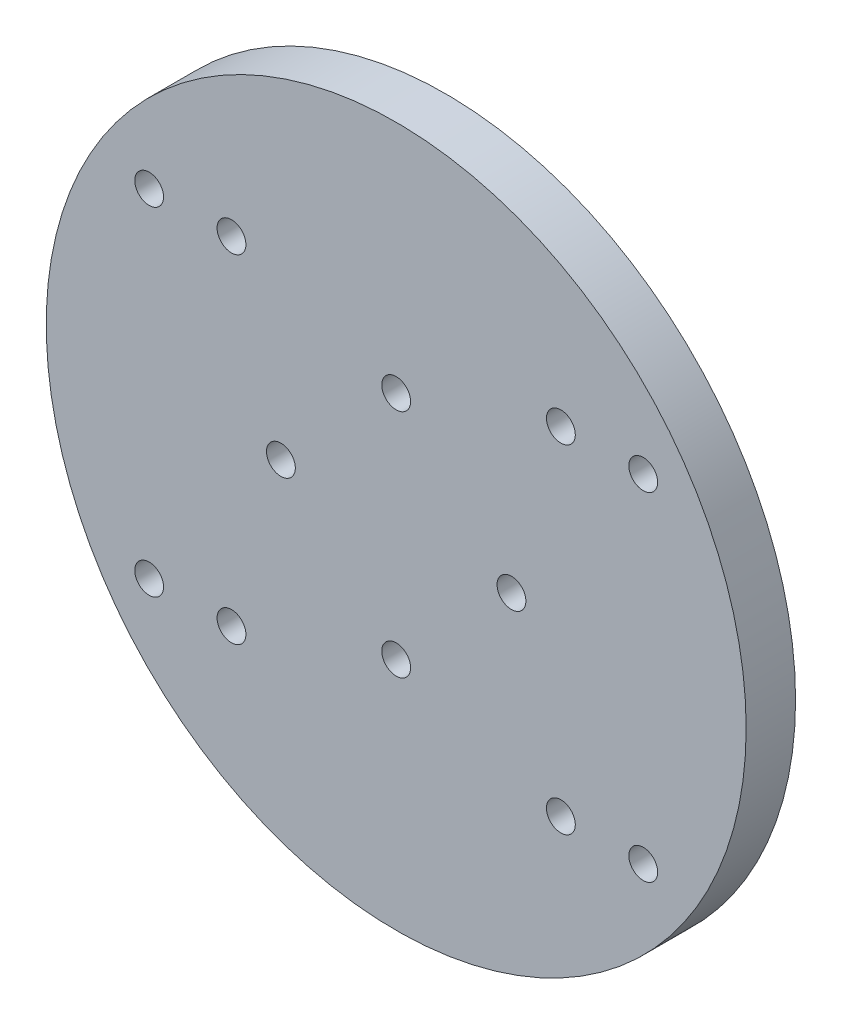
ISO-10303-21;
HEADER;
FILE_DESCRIPTION(('STEP AP214'),'2;1');
FILE_NAME('part.step','',(''),(''),'','','');
FILE_SCHEMA(('AUTOMOTIVE_DESIGN { 1 0 10303 214 1 1 1 1 }'));
ENDSEC;
DATA;
#1=APPLICATION_CONTEXT('core data for automotive mechanical design processes');
#2=APPLICATION_PROTOCOL_DEFINITION('international standard','automotive_design',2000,#1);
#3=PRODUCT_CONTEXT('',#1,'mechanical');
#4=PRODUCT('Part','Part','',(#3));
#5=PRODUCT_RELATED_PRODUCT_CATEGORY('part','',(#4));
#6=PRODUCT_DEFINITION_FORMATION('','',#4);
#7=PRODUCT_DEFINITION_CONTEXT('part definition',#1,'design');
#8=PRODUCT_DEFINITION('design','',#6,#7);
#9=PRODUCT_DEFINITION_SHAPE('','',#8);
#10=(LENGTH_UNIT() NAMED_UNIT(*) SI_UNIT(.MILLI.,.METRE.));
#11=(NAMED_UNIT(*) PLANE_ANGLE_UNIT() SI_UNIT($,.RADIAN.));
#12=(NAMED_UNIT(*) SI_UNIT($,.STERADIAN.) SOLID_ANGLE_UNIT());
#13=UNCERTAINTY_MEASURE_WITH_UNIT(LENGTH_MEASURE(1.E-05),#10,'distance_accuracy_value','');
#14=(GEOMETRIC_REPRESENTATION_CONTEXT(3) GLOBAL_UNCERTAINTY_ASSIGNED_CONTEXT((#13)) GLOBAL_UNIT_ASSIGNED_CONTEXT((#10,
#11,#12)) REPRESENTATION_CONTEXT('',''));
#15=CARTESIAN_POINT('',(0.,0.,0.));
#16=DIRECTION('',(0.,0.,1.));
#17=DIRECTION('',(1.,0.,0.));
#18=AXIS2_PLACEMENT_3D('',#15,#16,#17);
#19=CARTESIAN_POINT('',(0.,0.,0.));
#20=DIRECTION('',(0.,0.,1.));
#21=DIRECTION('',(1.,0.,0.));
#22=AXIS2_PLACEMENT_3D('',#19,#20,#21);
#23=PLANE('',#22);
#24=CARTESIAN_POINT('',(-29.9999914227974,-20.5,0.));
#25=DIRECTION('',(0.,0.,1.));
#26=DIRECTION('',(1.,0.,0.));
#27=AXIS2_PLACEMENT_3D('',#24,#25,#26);
#28=CIRCLE('',#27,2.9);
#29=CARTESIAN_POINT('',(-27.0999914227974,-20.5,0.));
#30=VERTEX_POINT('',#29);
#31=EDGE_CURVE('E273',#30,#30,#28,.T.);
#32=ORIENTED_EDGE('',*,*,#31,.T.);
#33=EDGE_LOOP('',(#32));
#34=FACE_BOUND('',#33,.T.);
#35=CARTESIAN_POINT('',(29.9999914227974,-20.5,0.));
#36=DIRECTION('',(0.,0.,-1.));
#37=DIRECTION('',(-1.,0.,0.));
#38=AXIS2_PLACEMENT_3D('',#35,#36,#37);
#39=CIRCLE('',#38,2.9);
#40=CARTESIAN_POINT('',(27.0999914227974,-20.5,0.));
#41=VERTEX_POINT('',#40);
#42=EDGE_CURVE('E285',#41,#41,#39,.T.);
#43=ORIENTED_EDGE('',*,*,#42,.F.);
#44=EDGE_LOOP('',(#43));
#45=FACE_BOUND('',#44,.T.);
#46=CARTESIAN_POINT('',(29.9999914227976,20.5,0.));
#47=DIRECTION('',(0.,0.,-1.));
#48=DIRECTION('',(-1.,0.,0.));
#49=AXIS2_PLACEMENT_3D('',#46,#47,#48);
#50=CIRCLE('',#49,2.9);
#51=CARTESIAN_POINT('',(27.0999914227976,20.5,0.));
#52=VERTEX_POINT('',#51);
#53=EDGE_CURVE('E282',#52,#52,#50,.T.);
#54=ORIENTED_EDGE('',*,*,#53,.F.);
#55=EDGE_LOOP('',(#54));
#56=FACE_BOUND('',#55,.T.);
#57=CARTESIAN_POINT('',(19.9999914227974,-20.5,0.));
#58=DIRECTION('',(0.,0.,1.));
#59=DIRECTION('',(1.,0.,0.));
#60=AXIS2_PLACEMENT_3D('',#57,#58,#59);
#61=CIRCLE('',#60,2.9);
#62=CARTESIAN_POINT('',(22.8999914227974,-20.5,0.));
#63=VERTEX_POINT('',#62);
#64=EDGE_CURVE('E145',#63,#63,#61,.T.);
#65=ORIENTED_EDGE('',*,*,#64,.T.);
#66=EDGE_LOOP('',(#65));
#67=FACE_BOUND('',#66,.T.);
#68=CARTESIAN_POINT('',(-19.9999914227974,-20.5,0.));
#69=DIRECTION('',(0.,0.,1.));
#70=DIRECTION('',(1.,0.,0.));
#71=AXIS2_PLACEMENT_3D('',#68,#69,#70);
#72=CIRCLE('',#71,2.9);
#73=CARTESIAN_POINT('',(-17.0999914227974,-20.5,0.));
#74=VERTEX_POINT('',#73);
#75=EDGE_CURVE('E137',#74,#74,#72,.T.);
#76=ORIENTED_EDGE('',*,*,#75,.T.);
#77=EDGE_LOOP('',(#76));
#78=FACE_BOUND('',#77,.T.);
#79=CARTESIAN_POINT('',(-19.9999914227974,20.5,0.));
#80=DIRECTION('',(0.,0.,1.));
#81=DIRECTION('',(1.,0.,0.));
#82=AXIS2_PLACEMENT_3D('',#79,#80,#81);
#83=CIRCLE('',#82,2.9);
#84=CARTESIAN_POINT('',(-17.0999914227974,20.5,0.));
#85=VERTEX_POINT('',#84);
#86=EDGE_CURVE('E128',#85,#85,#83,.T.);
#87=ORIENTED_EDGE('',*,*,#86,.T.);
#88=EDGE_LOOP('',(#87));
#89=FACE_BOUND('',#88,.T.);
#90=CARTESIAN_POINT('',(19.9999914227974,20.5,0.));
#91=DIRECTION('',(0.,0.,1.));
#92=DIRECTION('',(1.,0.,0.));
#93=AXIS2_PLACEMENT_3D('',#90,#91,#92);
#94=CIRCLE('',#93,2.9);
#95=CARTESIAN_POINT('',(22.8999914227974,20.5,0.));
#96=VERTEX_POINT('',#95);
#97=EDGE_CURVE('E132',#96,#96,#94,.T.);
#98=ORIENTED_EDGE('',*,*,#97,.T.);
#99=EDGE_LOOP('',(#98));
#100=FACE_BOUND('',#99,.T.);
#101=CARTESIAN_POINT('',(0.,0.,0.));
#102=DIRECTION('',(0.,0.,-1.));
#103=DIRECTION('',(-1.,0.,0.));
#104=AXIS2_PLACEMENT_3D('',#101,#102,#103);
#105=CIRCLE('',#104,22.);
#106=CARTESIAN_POINT('',(-22.,0.,0.));
#107=VERTEX_POINT('',#106);
#108=EDGE_CURVE('E52',#107,#107,#105,.T.);
#109=ORIENTED_EDGE('',*,*,#108,.F.);
#110=EDGE_LOOP('',(#109));
#111=FACE_BOUND('',#110,.T.);
#112=CARTESIAN_POINT('',(0.,0.,0.));
#113=DIRECTION('',(0.,0.,1.));
#114=DIRECTION('',(1.,0.,0.));
#115=AXIS2_PLACEMENT_3D('',#112,#113,#114);
#116=CIRCLE('',#115,42.5);
#117=CARTESIAN_POINT('',(42.5,0.,0.));
#118=VERTEX_POINT('',#117);
#119=EDGE_CURVE('E67',#118,#118,#116,.T.);
#120=ORIENTED_EDGE('',*,*,#119,.F.);
#121=EDGE_LOOP('',(#120));
#122=FACE_BOUND('',#121,.T.);
#123=CARTESIAN_POINT('',(-29.9999914227976,20.5,0.));
#124=DIRECTION('',(0.,0.,1.));
#125=DIRECTION('',(1.,0.,0.));
#126=AXIS2_PLACEMENT_3D('',#123,#124,#125);
#127=CIRCLE('',#126,2.9);
#128=CARTESIAN_POINT('',(-27.0999914227976,20.5,0.));
#129=VERTEX_POINT('',#128);
#130=EDGE_CURVE('E264',#129,#129,#127,.T.);
#131=ORIENTED_EDGE('',*,*,#130,.T.);
#132=EDGE_LOOP('',(#131));
#133=FACE_BOUND('',#132,.T.);
#134=ADVANCED_FACE('F43',(#34,#45,#56,#67,#78,#89,#100,#111,#122,#133),#23,.F.);
#135=CARTESIAN_POINT('',(29.9999914227976,20.5,-4.));
#136=DIRECTION('',(0.,0.,1.));
#137=DIRECTION('',(1.,0.,0.));
#138=AXIS2_PLACEMENT_3D('',#135,#136,#137);
#139=CYLINDRICAL_SURFACE('',#138,1.75);
#140=CARTESIAN_POINT('',(29.9999914227976,20.5,6.));
#141=DIRECTION('',(0.,0.,-1.));
#142=DIRECTION('',(-1.,0.,0.));
#143=AXIS2_PLACEMENT_3D('',#140,#141,#142);
#144=CIRCLE('',#143,1.75);
#145=CARTESIAN_POINT('',(28.2499914227976,20.5,6.));
#146=VERTEX_POINT('',#145);
#147=EDGE_CURVE('E113',#146,#146,#144,.T.);
#148=ORIENTED_EDGE('',*,*,#147,.F.);
#149=EDGE_LOOP('',(#148));
#150=FACE_BOUND('',#149,.T.);
#151=CARTESIAN_POINT('',(29.9999914227976,20.5,3.3));
#152=DIRECTION('',(0.,0.,-1.));
#153=DIRECTION('',(-1.,0.,0.));
#154=AXIS2_PLACEMENT_3D('',#151,#152,#153);
#155=CIRCLE('',#154,1.75);
#156=CARTESIAN_POINT('',(28.2499914227976,20.5,3.3));
#157=VERTEX_POINT('',#156);
#158=EDGE_CURVE('E97',#157,#157,#155,.T.);
#159=ORIENTED_EDGE('',*,*,#158,.T.);
#160=EDGE_LOOP('',(#159));
#161=FACE_BOUND('',#160,.T.);
#162=ADVANCED_FACE('F234',(#150,#161),#139,.F.);
#163=CARTESIAN_POINT('',(29.9999914227974,-20.5,-4.));
#164=DIRECTION('',(0.,0.,1.));
#165=DIRECTION('',(1.,0.,0.));
#166=AXIS2_PLACEMENT_3D('',#163,#164,#165);
#167=CYLINDRICAL_SURFACE('',#166,1.75);
#168=CARTESIAN_POINT('',(29.9999914227974,-20.5,6.));
#169=DIRECTION('',(0.,0.,-1.));
#170=DIRECTION('',(-1.,0.,0.));
#171=AXIS2_PLACEMENT_3D('',#168,#169,#170);
#172=CIRCLE('',#171,1.75);
#173=CARTESIAN_POINT('',(28.2499914227974,-20.5,6.));
#174=VERTEX_POINT('',#173);
#175=EDGE_CURVE('E108',#174,#174,#172,.T.);
#176=ORIENTED_EDGE('',*,*,#175,.F.);
#177=EDGE_LOOP('',(#176));
#178=FACE_BOUND('',#177,.T.);
#179=CARTESIAN_POINT('',(29.9999914227974,-20.5,3.3));
#180=DIRECTION('',(0.,0.,-1.));
#181=DIRECTION('',(-1.,0.,0.));
#182=AXIS2_PLACEMENT_3D('',#179,#180,#181);
#183=CIRCLE('',#182,1.75);
#184=CARTESIAN_POINT('',(28.2499914227974,-20.5,3.3));
#185=VERTEX_POINT('',#184);
#186=EDGE_CURVE('E93',#185,#185,#183,.T.);
#187=ORIENTED_EDGE('',*,*,#186,.T.);
#188=EDGE_LOOP('',(#187));
#189=FACE_BOUND('',#188,.T.);
#190=ADVANCED_FACE('F240',(#178,#189),#167,.F.);
#191=CARTESIAN_POINT('',(0.,0.,6.));
#192=DIRECTION('',(0.,0.,1.));
#193=DIRECTION('',(1.,0.,0.));
#194=AXIS2_PLACEMENT_3D('',#191,#192,#193);
#195=PLANE('',#194);
#196=ORIENTED_EDGE('',*,*,#147,.T.);
#197=EDGE_LOOP('',(#196));
#198=FACE_BOUND('',#197,.T.);
#199=CARTESIAN_POINT('',(-29.9999914227976,20.5,6.));
#200=DIRECTION('',(0.,0.,1.));
#201=DIRECTION('',(1.,0.,0.));
#202=AXIS2_PLACEMENT_3D('',#199,#200,#201);
#203=CIRCLE('',#202,1.75);
#204=CARTESIAN_POINT('',(-28.2499914227976,20.5,6.));
#205=VERTEX_POINT('',#204);
#206=EDGE_CURVE('E119',#205,#205,#203,.T.);
#207=ORIENTED_EDGE('',*,*,#206,.F.);
#208=EDGE_LOOP('',(#207));
#209=FACE_BOUND('',#208,.T.);
#210=CARTESIAN_POINT('',(-29.9999914227974,-20.5,6.));
#211=DIRECTION('',(0.,0.,1.));
#212=DIRECTION('',(1.,0.,0.));
#213=AXIS2_PLACEMENT_3D('',#210,#211,#212);
#214=CIRCLE('',#213,1.75);
#215=CARTESIAN_POINT('',(-28.2499914227974,-20.5,6.));
#216=VERTEX_POINT('',#215);
#217=EDGE_CURVE('E123',#216,#216,#214,.T.);
#218=ORIENTED_EDGE('',*,*,#217,.F.);
#219=EDGE_LOOP('',(#218));
#220=FACE_BOUND('',#219,.T.);
#221=CARTESIAN_POINT('',(19.9999914227974,20.5,6.));
#222=DIRECTION('',(0.,0.,1.));
#223=DIRECTION('',(1.,0.,0.));
#224=AXIS2_PLACEMENT_3D('',#221,#222,#223);
#225=CIRCLE('',#224,1.75);
#226=CARTESIAN_POINT('',(21.7499914227974,20.5,6.));
#227=VERTEX_POINT('',#226);
#228=EDGE_CURVE('E158',#227,#227,#225,.T.);
#229=ORIENTED_EDGE('',*,*,#228,.F.);
#230=EDGE_LOOP('',(#229));
#231=FACE_BOUND('',#230,.T.);
#232=CARTESIAN_POINT('',(19.9999914227974,-20.5,6.));
#233=DIRECTION('',(0.,0.,1.));
#234=DIRECTION('',(1.,0.,0.));
#235=AXIS2_PLACEMENT_3D('',#232,#233,#234);
#236=CIRCLE('',#235,1.75);
#237=CARTESIAN_POINT('',(21.7499914227974,-20.5,6.));
#238=VERTEX_POINT('',#237);
#239=EDGE_CURVE('E162',#238,#238,#236,.T.);
#240=ORIENTED_EDGE('',*,*,#239,.F.);
#241=EDGE_LOOP('',(#240));
#242=FACE_BOUND('',#241,.T.);
#243=CARTESIAN_POINT('',(-14.,0.,6.));
#244=DIRECTION('',(0.,0.,-1.));
#245=DIRECTION('',(-1.,0.,0.));
#246=AXIS2_PLACEMENT_3D('',#243,#244,#245);
#247=CIRCLE('',#246,1.75);
#248=CARTESIAN_POINT('',(-15.75,0.,6.));
#249=VERTEX_POINT('',#248);
#250=EDGE_CURVE('E174',#249,#249,#247,.T.);
#251=ORIENTED_EDGE('',*,*,#250,.T.);
#252=EDGE_LOOP('',(#251));
#253=FACE_BOUND('',#252,.T.);
#254=CARTESIAN_POINT('',(0.,-14.,6.));
#255=DIRECTION('',(0.,0.,-1.));
#256=DIRECTION('',(-1.,0.,0.));
#257=AXIS2_PLACEMENT_3D('',#254,#255,#256);
#258=CIRCLE('',#257,1.75);
#259=CARTESIAN_POINT('',(-1.74999999999995,-14.,6.));
#260=VERTEX_POINT('',#259);
#261=EDGE_CURVE('E187',#260,#260,#258,.T.);
#262=ORIENTED_EDGE('',*,*,#261,.T.);
#263=EDGE_LOOP('',(#262));
#264=FACE_BOUND('',#263,.T.);
#265=CARTESIAN_POINT('',(14.,0.,6.));
#266=DIRECTION('',(0.,0.,-1.));
#267=DIRECTION('',(-1.,0.,0.));
#268=AXIS2_PLACEMENT_3D('',#265,#266,#267);
#269=CIRCLE('',#268,1.75);
#270=CARTESIAN_POINT('',(12.25,0.,6.));
#271=VERTEX_POINT('',#270);
#272=EDGE_CURVE('E195',#271,#271,#269,.T.);
#273=ORIENTED_EDGE('',*,*,#272,.T.);
#274=EDGE_LOOP('',(#273));
#275=FACE_BOUND('',#274,.T.);
#276=CARTESIAN_POINT('',(-1.46707548625861E-13,14.,6.));
#277=DIRECTION('',(0.,0.,-1.));
#278=DIRECTION('',(-1.,0.,0.));
#279=AXIS2_PLACEMENT_3D('',#276,#277,#278);
#280=CIRCLE('',#279,1.75);
#281=CARTESIAN_POINT('',(-1.75000000000015,14.,6.));
#282=VERTEX_POINT('',#281);
#283=EDGE_CURVE('E173',#282,#282,#280,.T.);
#284=ORIENTED_EDGE('',*,*,#283,.T.);
#285=EDGE_LOOP('',(#284));
#286=FACE_BOUND('',#285,.T.);
#287=CARTESIAN_POINT('',(0.,0.,6.));
#288=DIRECTION('',(0.,0.,1.));
#289=DIRECTION('',(1.,0.,0.));
#290=AXIS2_PLACEMENT_3D('',#287,#288,#289);
#291=CIRCLE('',#290,42.5);
#292=CARTESIAN_POINT('',(42.5,0.,6.));
#293=VERTEX_POINT('',#292);
#294=EDGE_CURVE('E58',#293,#293,#291,.T.);
#295=ORIENTED_EDGE('',*,*,#294,.T.);
#296=EDGE_LOOP('',(#295));
#297=FACE_BOUND('',#296,.T.);
#298=CARTESIAN_POINT('',(-19.9999914227974,20.5,6.));
#299=DIRECTION('',(0.,0.,-1.));
#300=DIRECTION('',(-1.,0.,0.));
#301=AXIS2_PLACEMENT_3D('',#298,#299,#300);
#302=CIRCLE('',#301,1.75);
#303=CARTESIAN_POINT('',(-21.7499914227974,20.5,6.));
#304=VERTEX_POINT('',#303);
#305=EDGE_CURVE('E163',#304,#304,#302,.T.);
#306=ORIENTED_EDGE('',*,*,#305,.T.);
#307=EDGE_LOOP('',(#306));
#308=FACE_BOUND('',#307,.T.);
#309=CARTESIAN_POINT('',(-19.9999914227974,-20.5,6.));
#310=DIRECTION('',(0.,0.,-1.));
#311=DIRECTION('',(-1.,0.,0.));
#312=AXIS2_PLACEMENT_3D('',#309,#310,#311);
#313=CIRCLE('',#312,1.75);
#314=CARTESIAN_POINT('',(-21.7499914227974,-20.5,6.));
#315=VERTEX_POINT('',#314);
#316=EDGE_CURVE('E92',#315,#315,#313,.T.);
#317=ORIENTED_EDGE('',*,*,#316,.T.);
#318=EDGE_LOOP('',(#317));
#319=FACE_BOUND('',#318,.T.);
#320=ORIENTED_EDGE('',*,*,#175,.T.);
#321=EDGE_LOOP('',(#320));
#322=FACE_BOUND('',#321,.T.);
#323=ADVANCED_FACE('F246',(#198,#209,#220,#231,#242,#253,#264,#275,#286,#297,#308,#319,#322),
#195,.T.);
#324=CARTESIAN_POINT('',(0.,0.,6.));
#325=DIRECTION('',(0.,0.,-1.));
#326=DIRECTION('',(-1.,0.,0.));
#327=AXIS2_PLACEMENT_3D('',#324,#325,#326);
#328=CYLINDRICAL_SURFACE('',#327,42.5);
#329=ORIENTED_EDGE('',*,*,#294,.F.);
#330=EDGE_LOOP('',(#329));
#331=FACE_BOUND('',#330,.T.);
#332=ORIENTED_EDGE('',*,*,#119,.T.);
#333=EDGE_LOOP('',(#332));
#334=FACE_BOUND('',#333,.T.);
#335=ADVANCED_FACE('F45',(#331,#334),#328,.T.);
#336=CARTESIAN_POINT('',(0.,0.,-6.));
#337=DIRECTION('',(0.,0.,1.));
#338=DIRECTION('',(1.,0.,0.));
#339=AXIS2_PLACEMENT_3D('',#336,#337,#338);
#340=CYLINDRICAL_SURFACE('',#339,22.);
#341=CARTESIAN_POINT('',(0.,0.,-6.));
#342=DIRECTION('',(0.,0.,-1.));
#343=DIRECTION('',(-1.,0.,0.));
#344=AXIS2_PLACEMENT_3D('',#341,#342,#343);
#345=CIRCLE('',#344,22.);
#346=CARTESIAN_POINT('',(-22.,0.,-6.));
#347=VERTEX_POINT('',#346);
#348=EDGE_CURVE('E64',#347,#347,#345,.T.);
#349=ORIENTED_EDGE('',*,*,#348,.F.);
#350=EDGE_LOOP('',(#349));
#351=FACE_BOUND('',#350,.T.);
#352=ORIENTED_EDGE('',*,*,#108,.T.);
#353=EDGE_LOOP('',(#352));
#354=FACE_BOUND('',#353,.T.);
#355=ADVANCED_FACE('F230',(#351,#354),#340,.T.);
#356=CARTESIAN_POINT('',(0.,0.,-6.));
#357=DIRECTION('',(0.,0.,-1.));
#358=DIRECTION('',(-1.,0.,0.));
#359=AXIS2_PLACEMENT_3D('',#356,#357,#358);
#360=PLANE('',#359);
#361=CARTESIAN_POINT('',(0.,0.,-6.));
#362=DIRECTION('',(0.,0.,-1.));
#363=DIRECTION('',(-1.,0.,0.));
#364=AXIS2_PLACEMENT_3D('',#361,#362,#363);
#365=CIRCLE('',#364,20.1);
#366=CARTESIAN_POINT('',(-20.1,0.,-6.));
#367=VERTEX_POINT('',#366);
#368=EDGE_CURVE('E10',#367,#367,#365,.T.);
#369=ORIENTED_EDGE('',*,*,#368,.F.);
#370=EDGE_LOOP('',(#369));
#371=FACE_BOUND('',#370,.T.);
#372=ORIENTED_EDGE('',*,*,#348,.T.);
#373=EDGE_LOOP('',(#372));
#374=FACE_BOUND('',#373,.T.);
#375=ADVANCED_FACE('F225',(#371,#374),#360,.T.);
#376=CARTESIAN_POINT('',(0.,0.,-10.7));
#377=DIRECTION('',(0.,0.,1.));
#378=DIRECTION('',(1.,0.,0.));
#379=AXIS2_PLACEMENT_3D('',#376,#377,#378);
#380=CYLINDRICAL_SURFACE('',#379,20.1);
#381=CARTESIAN_POINT('',(0.,0.,-10.7));
#382=DIRECTION('',(0.,0.,-1.));
#383=DIRECTION('',(-1.,0.,0.));
#384=AXIS2_PLACEMENT_3D('',#381,#382,#383);
#385=CIRCLE('',#384,20.1);
#386=CARTESIAN_POINT('',(-20.1,0.,-10.7));
#387=VERTEX_POINT('',#386);
#388=EDGE_CURVE('E62',#387,#387,#385,.T.);
#389=ORIENTED_EDGE('',*,*,#388,.F.);
#390=EDGE_LOOP('',(#389));
#391=FACE_BOUND('',#390,.T.);
#392=ORIENTED_EDGE('',*,*,#368,.T.);
#393=EDGE_LOOP('',(#392));
#394=FACE_BOUND('',#393,.T.);
#395=ADVANCED_FACE('F218',(#391,#394),#380,.T.);
#396=CARTESIAN_POINT('',(0.,0.,-10.7));
#397=DIRECTION('',(0.,0.,-1.));
#398=DIRECTION('',(-1.,0.,0.));
#399=AXIS2_PLACEMENT_3D('',#396,#397,#398);
#400=PLANE('',#399);
#401=CARTESIAN_POINT('',(0.,0.,-10.7));
#402=DIRECTION('',(0.,0.,-1.));
#403=DIRECTION('',(-1.,0.,0.));
#404=AXIS2_PLACEMENT_3D('',#401,#402,#403);
#405=CIRCLE('',#404,18.1);
#406=CARTESIAN_POINT('',(-18.1,0.,-10.7));
#407=VERTEX_POINT('',#406);
#408=EDGE_CURVE('E178',#407,#407,#405,.T.);
#409=ORIENTED_EDGE('',*,*,#408,.F.);
#410=EDGE_LOOP('',(#409));
#411=FACE_BOUND('',#410,.T.);
#412=ORIENTED_EDGE('',*,*,#388,.T.);
#413=EDGE_LOOP('',(#412));
#414=FACE_BOUND('',#413,.T.);
#415=ADVANCED_FACE('F215',(#411,#414),#400,.T.);
#416=CARTESIAN_POINT('',(0.,0.,0.299999999999998));
#417=DIRECTION('',(0.,0.,-1.));
#418=DIRECTION('',(-1.,0.,0.));
#419=AXIS2_PLACEMENT_3D('',#416,#417,#418);
#420=CYLINDRICAL_SURFACE('',#419,18.1);
#421=CARTESIAN_POINT('',(0.,0.,0.299999999999998));
#422=DIRECTION('',(0.,0.,-1.));
#423=DIRECTION('',(-1.,0.,0.));
#424=AXIS2_PLACEMENT_3D('',#421,#422,#423);
#425=CIRCLE('',#424,18.1);
#426=CARTESIAN_POINT('',(-18.1,0.,0.299999999999998));
#427=VERTEX_POINT('',#426);
#428=EDGE_CURVE('E206',#427,#427,#425,.T.);
#429=ORIENTED_EDGE('',*,*,#428,.F.);
#430=EDGE_LOOP('',(#429));
#431=FACE_BOUND('',#430,.T.);
#432=ORIENTED_EDGE('',*,*,#408,.T.);
#433=EDGE_LOOP('',(#432));
#434=FACE_BOUND('',#433,.T.);
#435=ADVANCED_FACE('F213',(#431,#434),#420,.F.);
#436=CARTESIAN_POINT('',(0.,0.,0.299999999999998));
#437=DIRECTION('',(0.,0.,-1.));
#438=DIRECTION('',(-1.,0.,0.));
#439=AXIS2_PLACEMENT_3D('',#436,#437,#438);
#440=PLANE('',#439);
#441=CARTESIAN_POINT('',(-14.,0.,0.299999999999998));
#442=DIRECTION('',(0.,0.,-1.));
#443=DIRECTION('',(-1.,0.,0.));
#444=AXIS2_PLACEMENT_3D('',#441,#442,#443);
#445=CIRCLE('',#444,1.75);
#446=CARTESIAN_POINT('',(-15.75,0.,0.299999999999998));
#447=VERTEX_POINT('',#446);
#448=EDGE_CURVE('E179',#447,#447,#445,.T.);
#449=ORIENTED_EDGE('',*,*,#448,.F.);
#450=EDGE_LOOP('',(#449));
#451=FACE_BOUND('',#450,.T.);
#452=CARTESIAN_POINT('',(0.,-14.,0.299999999999998));
#453=DIRECTION('',(0.,0.,-1.));
#454=DIRECTION('',(-1.,0.,0.));
#455=AXIS2_PLACEMENT_3D('',#452,#453,#454);
#456=CIRCLE('',#455,1.75);
#457=CARTESIAN_POINT('',(-1.74999999999995,-14.,0.299999999999998));
#458=VERTEX_POINT('',#457);
#459=EDGE_CURVE('E183',#458,#458,#456,.T.);
#460=ORIENTED_EDGE('',*,*,#459,.F.);
#461=EDGE_LOOP('',(#460));
#462=FACE_BOUND('',#461,.T.);
#463=CARTESIAN_POINT('',(14.,0.,0.299999999999998));
#464=DIRECTION('',(0.,0.,-1.));
#465=DIRECTION('',(-1.,0.,0.));
#466=AXIS2_PLACEMENT_3D('',#463,#464,#465);
#467=CIRCLE('',#466,1.75);
#468=CARTESIAN_POINT('',(12.25,0.,0.299999999999998));
#469=VERTEX_POINT('',#468);
#470=EDGE_CURVE('E191',#469,#469,#467,.T.);
#471=ORIENTED_EDGE('',*,*,#470,.F.);
#472=EDGE_LOOP('',(#471));
#473=FACE_BOUND('',#472,.T.);
#474=CARTESIAN_POINT('',(-1.46707548625861E-13,14.,0.299999999999998));
#475=DIRECTION('',(0.,0.,-1.));
#476=DIRECTION('',(-1.,0.,0.));
#477=AXIS2_PLACEMENT_3D('',#474,#475,#476);
#478=CIRCLE('',#477,1.75);
#479=CARTESIAN_POINT('',(-1.75000000000015,14.,0.299999999999998));
#480=VERTEX_POINT('',#479);
#481=EDGE_CURVE('E199',#480,#480,#478,.T.);
#482=ORIENTED_EDGE('',*,*,#481,.F.);
#483=EDGE_LOOP('',(#482));
#484=FACE_BOUND('',#483,.T.);
#485=ORIENTED_EDGE('',*,*,#428,.T.);
#486=EDGE_LOOP('',(#485));
#487=FACE_BOUND('',#486,.T.);
#488=ADVANCED_FACE('F350',(#451,#462,#473,#484,#487),#440,.T.);
#489=CARTESIAN_POINT('',(-1.46707548625861E-13,14.,6.));
#490=DIRECTION('',(0.,0.,-1.));
#491=DIRECTION('',(-1.,0.,0.));
#492=AXIS2_PLACEMENT_3D('',#489,#490,#491);
#493=CYLINDRICAL_SURFACE('',#492,1.75);
#494=ORIENTED_EDGE('',*,*,#283,.F.);
#495=EDGE_LOOP('',(#494));
#496=FACE_BOUND('',#495,.T.);
#497=ORIENTED_EDGE('',*,*,#481,.T.);
#498=EDGE_LOOP('',(#497));
#499=FACE_BOUND('',#498,.T.);
#500=ADVANCED_FACE('F346',(#496,#499),#493,.F.);
#501=CARTESIAN_POINT('',(14.,0.,6.));
#502=DIRECTION('',(0.,0.,-1.));
#503=DIRECTION('',(-1.,0.,0.));
#504=AXIS2_PLACEMENT_3D('',#501,#502,#503);
#505=CYLINDRICAL_SURFACE('',#504,1.75);
#506=ORIENTED_EDGE('',*,*,#272,.F.);
#507=EDGE_LOOP('',(#506));
#508=FACE_BOUND('',#507,.T.);
#509=ORIENTED_EDGE('',*,*,#470,.T.);
#510=EDGE_LOOP('',(#509));
#511=FACE_BOUND('',#510,.T.);
#512=ADVANCED_FACE('F342',(#508,#511),#505,.F.);
#513=CARTESIAN_POINT('',(0.,-14.,6.));
#514=DIRECTION('',(0.,0.,-1.));
#515=DIRECTION('',(-1.,0.,0.));
#516=AXIS2_PLACEMENT_3D('',#513,#514,#515);
#517=CYLINDRICAL_SURFACE('',#516,1.75);
#518=ORIENTED_EDGE('',*,*,#261,.F.);
#519=EDGE_LOOP('',(#518));
#520=FACE_BOUND('',#519,.T.);
#521=ORIENTED_EDGE('',*,*,#459,.T.);
#522=EDGE_LOOP('',(#521));
#523=FACE_BOUND('',#522,.T.);
#524=ADVANCED_FACE('F338',(#520,#523),#517,.F.);
#525=CARTESIAN_POINT('',(-14.,0.,6.));
#526=DIRECTION('',(0.,0.,-1.));
#527=DIRECTION('',(-1.,0.,0.));
#528=AXIS2_PLACEMENT_3D('',#525,#526,#527);
#529=CYLINDRICAL_SURFACE('',#528,1.75);
#530=ORIENTED_EDGE('',*,*,#250,.F.);
#531=EDGE_LOOP('',(#530));
#532=FACE_BOUND('',#531,.T.);
#533=ORIENTED_EDGE('',*,*,#448,.T.);
#534=EDGE_LOOP('',(#533));
#535=FACE_BOUND('',#534,.T.);
#536=ADVANCED_FACE('F334',(#532,#535),#529,.F.);
#537=CARTESIAN_POINT('',(19.9999914227974,-20.5,6.));
#538=DIRECTION('',(0.,0.,-1.));
#539=DIRECTION('',(-1.,0.,0.));
#540=AXIS2_PLACEMENT_3D('',#537,#538,#539);
#541=CYLINDRICAL_SURFACE('',#540,1.75);
#542=CARTESIAN_POINT('',(19.9999914227974,-20.5,3.3));
#543=DIRECTION('',(0.,0.,1.));
#544=DIRECTION('',(1.,0.,0.));
#545=AXIS2_PLACEMENT_3D('',#542,#543,#544);
#546=CIRCLE('',#545,1.75);
#547=CARTESIAN_POINT('',(21.7499914227974,-20.5,3.3));
#548=VERTEX_POINT('',#547);
#549=EDGE_CURVE('E88',#548,#548,#546,.T.);
#550=ORIENTED_EDGE('',*,*,#549,.F.);
#551=EDGE_LOOP('',(#550));
#552=FACE_BOUND('',#551,.T.);
#553=ORIENTED_EDGE('',*,*,#239,.T.);
#554=EDGE_LOOP('',(#553));
#555=FACE_BOUND('',#554,.T.);
#556=ADVANCED_FACE('F331',(#552,#555),#541,.F.);
#557=CARTESIAN_POINT('',(19.9999914227974,20.5,6.));
#558=DIRECTION('',(0.,0.,-1.));
#559=DIRECTION('',(-1.,0.,0.));
#560=AXIS2_PLACEMENT_3D('',#557,#558,#559);
#561=CYLINDRICAL_SURFACE('',#560,1.75);
#562=CARTESIAN_POINT('',(19.9999914227974,20.5,3.3));
#563=DIRECTION('',(0.,0.,1.));
#564=DIRECTION('',(1.,0.,0.));
#565=AXIS2_PLACEMENT_3D('',#562,#563,#564);
#566=CIRCLE('',#565,1.75);
#567=CARTESIAN_POINT('',(21.7499914227974,20.5,3.3));
#568=VERTEX_POINT('',#567);
#569=EDGE_CURVE('E84',#568,#568,#566,.T.);
#570=ORIENTED_EDGE('',*,*,#569,.F.);
#571=EDGE_LOOP('',(#570));
#572=FACE_BOUND('',#571,.T.);
#573=ORIENTED_EDGE('',*,*,#228,.T.);
#574=EDGE_LOOP('',(#573));
#575=FACE_BOUND('',#574,.T.);
#576=ADVANCED_FACE('F326',(#572,#575),#561,.F.);
#577=CARTESIAN_POINT('',(-19.9999914227974,20.5,6.));
#578=DIRECTION('',(0.,0.,-1.));
#579=DIRECTION('',(-1.,0.,0.));
#580=AXIS2_PLACEMENT_3D('',#577,#578,#579);
#581=CYLINDRICAL_SURFACE('',#580,1.75);
#582=CARTESIAN_POINT('',(-19.9999914227974,20.5,3.3));
#583=DIRECTION('',(0.,0.,1.));
#584=DIRECTION('',(1.,0.,0.));
#585=AXIS2_PLACEMENT_3D('',#582,#583,#584);
#586=CIRCLE('',#585,1.75);
#587=CARTESIAN_POINT('',(-18.2499914227974,20.5,3.3));
#588=VERTEX_POINT('',#587);
#589=EDGE_CURVE('E79',#588,#588,#586,.F.);
#590=ORIENTED_EDGE('',*,*,#589,.T.);
#591=EDGE_LOOP('',(#590));
#592=FACE_BOUND('',#591,.T.);
#593=ORIENTED_EDGE('',*,*,#305,.F.);
#594=EDGE_LOOP('',(#593));
#595=FACE_BOUND('',#594,.T.);
#596=ADVANCED_FACE('F316',(#592,#595),#581,.F.);
#597=CARTESIAN_POINT('',(-19.9999914227974,-20.5,6.));
#598=DIRECTION('',(0.,0.,-1.));
#599=DIRECTION('',(-1.,0.,0.));
#600=AXIS2_PLACEMENT_3D('',#597,#598,#599);
#601=CYLINDRICAL_SURFACE('',#600,1.75);
#602=CARTESIAN_POINT('',(-19.9999914227974,-20.5,3.3));
#603=DIRECTION('',(0.,0.,1.));
#604=DIRECTION('',(1.,0.,0.));
#605=AXIS2_PLACEMENT_3D('',#602,#603,#604);
#606=CIRCLE('',#605,1.75);
#607=CARTESIAN_POINT('',(-18.2499914227974,-20.5,3.3));
#608=VERTEX_POINT('',#607);
#609=EDGE_CURVE('E75',#608,#608,#606,.F.);
#610=ORIENTED_EDGE('',*,*,#609,.T.);
#611=EDGE_LOOP('',(#610));
#612=FACE_BOUND('',#611,.T.);
#613=ORIENTED_EDGE('',*,*,#316,.F.);
#614=EDGE_LOOP('',(#613));
#615=FACE_BOUND('',#614,.T.);
#616=ADVANCED_FACE('F313',(#612,#615),#601,.F.);
#617=CARTESIAN_POINT('',(-19.9999914227974,-20.5,3.3));
#618=DIRECTION('',(0.,0.,1.));
#619=DIRECTION('',(1.,0.,0.));
#620=AXIS2_PLACEMENT_3D('',#617,#618,#619);
#621=PLANE('',#620);
#622=CARTESIAN_POINT('',(-19.9999914227974,-20.5,3.3));
#623=DIRECTION('',(0.,0.,1.));
#624=DIRECTION('',(1.,0.,0.));
#625=AXIS2_PLACEMENT_3D('',#622,#623,#624);
#626=CIRCLE('',#625,2.9);
#627=CARTESIAN_POINT('',(-17.0999914227974,-20.5,3.3));
#628=VERTEX_POINT('',#627);
#629=EDGE_CURVE('E141',#628,#628,#626,.T.);
#630=ORIENTED_EDGE('',*,*,#629,.F.);
#631=EDGE_LOOP('',(#630));
#632=FACE_BOUND('',#631,.T.);
#633=ORIENTED_EDGE('',*,*,#609,.F.);
#634=EDGE_LOOP('',(#633));
#635=FACE_BOUND('',#634,.T.);
#636=ADVANCED_FACE('F315',(#632,#635),#621,.F.);
#637=CARTESIAN_POINT('',(-19.9999914227974,-20.5,3.3));
#638=DIRECTION('',(0.,0.,-1.));
#639=DIRECTION('',(-1.,0.,0.));
#640=AXIS2_PLACEMENT_3D('',#637,#638,#639);
#641=CYLINDRICAL_SURFACE('',#640,2.9);
#642=ORIENTED_EDGE('',*,*,#629,.T.);
#643=EDGE_LOOP('',(#642));
#644=FACE_BOUND('',#643,.T.);
#645=ORIENTED_EDGE('',*,*,#75,.F.);
#646=EDGE_LOOP('',(#645));
#647=FACE_BOUND('',#646,.T.);
#648=ADVANCED_FACE('F323',(#644,#647),#641,.F.);
#649=CARTESIAN_POINT('',(-19.9999914227974,20.5,3.3));
#650=DIRECTION('',(0.,0.,1.));
#651=DIRECTION('',(1.,0.,0.));
#652=AXIS2_PLACEMENT_3D('',#649,#650,#651);
#653=PLANE('',#652);
#654=CARTESIAN_POINT('',(-19.9999914227974,20.5,3.3));
#655=DIRECTION('',(0.,0.,1.));
#656=DIRECTION('',(1.,0.,0.));
#657=AXIS2_PLACEMENT_3D('',#654,#655,#656);
#658=CIRCLE('',#657,2.9);
#659=CARTESIAN_POINT('',(-17.0999914227974,20.5,3.3));
#660=VERTEX_POINT('',#659);
#661=EDGE_CURVE('E133',#660,#660,#658,.T.);
#662=ORIENTED_EDGE('',*,*,#661,.F.);
#663=EDGE_LOOP('',(#662));
#664=FACE_BOUND('',#663,.T.);
#665=ORIENTED_EDGE('',*,*,#589,.F.);
#666=EDGE_LOOP('',(#665));
#667=FACE_BOUND('',#666,.T.);
#668=ADVANCED_FACE('F425',(#664,#667),#653,.F.);
#669=CARTESIAN_POINT('',(-19.9999914227974,20.5,3.3));
#670=DIRECTION('',(0.,0.,-1.));
#671=DIRECTION('',(-1.,0.,0.));
#672=AXIS2_PLACEMENT_3D('',#669,#670,#671);
#673=CYLINDRICAL_SURFACE('',#672,2.9);
#674=ORIENTED_EDGE('',*,*,#661,.T.);
#675=EDGE_LOOP('',(#674));
#676=FACE_BOUND('',#675,.T.);
#677=ORIENTED_EDGE('',*,*,#86,.F.);
#678=EDGE_LOOP('',(#677));
#679=FACE_BOUND('',#678,.T.);
#680=ADVANCED_FACE('F435',(#676,#679),#673,.F.);
#681=CARTESIAN_POINT('',(19.9999914227974,20.5,3.3));
#682=DIRECTION('',(0.,0.,-1.));
#683=DIRECTION('',(-1.,0.,0.));
#684=AXIS2_PLACEMENT_3D('',#681,#682,#683);
#685=CYLINDRICAL_SURFACE('',#684,2.9);
#686=CARTESIAN_POINT('',(19.9999914227974,20.5,3.3));
#687=DIRECTION('',(0.,0.,1.));
#688=DIRECTION('',(1.,0.,0.));
#689=AXIS2_PLACEMENT_3D('',#686,#687,#688);
#690=CIRCLE('',#689,2.9);
#691=CARTESIAN_POINT('',(22.8999914227974,20.5,3.3));
#692=VERTEX_POINT('',#691);
#693=EDGE_CURVE('E80',#692,#692,#690,.T.);
#694=ORIENTED_EDGE('',*,*,#693,.T.);
#695=EDGE_LOOP('',(#694));
#696=FACE_BOUND('',#695,.T.);
#697=ORIENTED_EDGE('',*,*,#97,.F.);
#698=EDGE_LOOP('',(#697));
#699=FACE_BOUND('',#698,.T.);
#700=ADVANCED_FACE('F445',(#696,#699),#685,.F.);
#701=CARTESIAN_POINT('',(19.9999914227974,20.5,3.3));
#702=DIRECTION('',(0.,0.,1.));
#703=DIRECTION('',(1.,0.,0.));
#704=AXIS2_PLACEMENT_3D('',#701,#702,#703);
#705=PLANE('',#704);
#706=ORIENTED_EDGE('',*,*,#569,.T.);
#707=EDGE_LOOP('',(#706));
#708=FACE_BOUND('',#707,.T.);
#709=ORIENTED_EDGE('',*,*,#693,.F.);
#710=EDGE_LOOP('',(#709));
#711=FACE_BOUND('',#710,.T.);
#712=ADVANCED_FACE('F455',(#708,#711),#705,.F.);
#713=CARTESIAN_POINT('',(19.9999914227974,-20.5,3.3));
#714=DIRECTION('',(0.,0.,-1.));
#715=DIRECTION('',(-1.,0.,0.));
#716=AXIS2_PLACEMENT_3D('',#713,#714,#715);
#717=CYLINDRICAL_SURFACE('',#716,2.9);
#718=CARTESIAN_POINT('',(19.9999914227974,-20.5,3.3));
#719=DIRECTION('',(0.,0.,1.));
#720=DIRECTION('',(1.,0.,0.));
#721=AXIS2_PLACEMENT_3D('',#718,#719,#720);
#722=CIRCLE('',#721,2.9);
#723=CARTESIAN_POINT('',(22.8999914227974,-20.5,3.3));
#724=VERTEX_POINT('',#723);
#725=EDGE_CURVE('E127',#724,#724,#722,.T.);
#726=ORIENTED_EDGE('',*,*,#725,.T.);
#727=EDGE_LOOP('',(#726));
#728=FACE_BOUND('',#727,.T.);
#729=ORIENTED_EDGE('',*,*,#64,.F.);
#730=EDGE_LOOP('',(#729));
#731=FACE_BOUND('',#730,.T.);
#732=ADVANCED_FACE('F465',(#728,#731),#717,.F.);
#733=CARTESIAN_POINT('',(19.9999914227974,-20.5,3.3));
#734=DIRECTION('',(0.,0.,1.));
#735=DIRECTION('',(1.,0.,0.));
#736=AXIS2_PLACEMENT_3D('',#733,#734,#735);
#737=PLANE('',#736);
#738=ORIENTED_EDGE('',*,*,#549,.T.);
#739=EDGE_LOOP('',(#738));
#740=FACE_BOUND('',#739,.T.);
#741=ORIENTED_EDGE('',*,*,#725,.F.);
#742=EDGE_LOOP('',(#741));
#743=FACE_BOUND('',#742,.T.);
#744=ADVANCED_FACE('F475',(#740,#743),#737,.F.);
#745=CARTESIAN_POINT('',(-29.9999914227974,-20.5,-4.));
#746=DIRECTION('',(0.,0.,1.));
#747=DIRECTION('',(1.,0.,0.));
#748=AXIS2_PLACEMENT_3D('',#745,#746,#747);
#749=CYLINDRICAL_SURFACE('',#748,1.75);
#750=CARTESIAN_POINT('',(-29.9999914227974,-20.5,3.3));
#751=DIRECTION('',(0.,0.,1.));
#752=DIRECTION('',(1.,0.,0.));
#753=AXIS2_PLACEMENT_3D('',#750,#751,#752);
#754=CIRCLE('',#753,1.75);
#755=CARTESIAN_POINT('',(-28.2499914227974,-20.5,3.3));
#756=VERTEX_POINT('',#755);
#757=EDGE_CURVE('E47',#756,#756,#754,.F.);
#758=ORIENTED_EDGE('',*,*,#757,.T.);
#759=EDGE_LOOP('',(#758));
#760=FACE_BOUND('',#759,.T.);
#761=ORIENTED_EDGE('',*,*,#217,.T.);
#762=EDGE_LOOP('',(#761));
#763=FACE_BOUND('',#762,.T.);
#764=ADVANCED_FACE('F485',(#760,#763),#749,.F.);
#765=CARTESIAN_POINT('',(-29.9999914227976,20.5,-4.));
#766=DIRECTION('',(0.,0.,1.));
#767=DIRECTION('',(1.,0.,0.));
#768=AXIS2_PLACEMENT_3D('',#765,#766,#767);
#769=CYLINDRICAL_SURFACE('',#768,1.75);
#770=CARTESIAN_POINT('',(-29.9999914227976,20.5,3.3));
#771=DIRECTION('',(0.,0.,1.));
#772=DIRECTION('',(1.,0.,0.));
#773=AXIS2_PLACEMENT_3D('',#770,#771,#772);
#774=CIRCLE('',#773,1.75);
#775=CARTESIAN_POINT('',(-28.2499914227976,20.5,3.3));
#776=VERTEX_POINT('',#775);
#777=EDGE_CURVE('E101',#776,#776,#774,.F.);
#778=ORIENTED_EDGE('',*,*,#777,.T.);
#779=EDGE_LOOP('',(#778));
#780=FACE_BOUND('',#779,.T.);
#781=ORIENTED_EDGE('',*,*,#206,.T.);
#782=EDGE_LOOP('',(#781));
#783=FACE_BOUND('',#782,.T.);
#784=ADVANCED_FACE('F290',(#780,#783),#769,.F.);
#785=CARTESIAN_POINT('',(29.9999914227974,-20.5,3.3));
#786=DIRECTION('',(0.,0.,-1.));
#787=DIRECTION('',(-1.,0.,0.));
#788=AXIS2_PLACEMENT_3D('',#785,#786,#787);
#789=CYLINDRICAL_SURFACE('',#788,2.9);
#790=CARTESIAN_POINT('',(29.9999914227974,-20.5,3.3));
#791=DIRECTION('',(0.,0.,-1.));
#792=DIRECTION('',(-1.,0.,0.));
#793=AXIS2_PLACEMENT_3D('',#790,#791,#792);
#794=CIRCLE('',#793,2.9);
#795=CARTESIAN_POINT('',(27.0999914227974,-20.5,3.3));
#796=VERTEX_POINT('',#795);
#797=EDGE_CURVE('E612',#796,#796,#794,.T.);
#798=ORIENTED_EDGE('',*,*,#797,.F.);
#799=EDGE_LOOP('',(#798));
#800=FACE_BOUND('',#799,.T.);
#801=ORIENTED_EDGE('',*,*,#42,.T.);
#802=EDGE_LOOP('',(#801));
#803=FACE_BOUND('',#802,.T.);
#804=ADVANCED_FACE('F510',(#800,#803),#789,.F.);
#805=CARTESIAN_POINT('',(29.9999914227974,-20.5,3.3));
#806=DIRECTION('',(0.,0.,-1.));
#807=DIRECTION('',(-1.,0.,0.));
#808=AXIS2_PLACEMENT_3D('',#805,#806,#807);
#809=PLANE('',#808);
#810=ORIENTED_EDGE('',*,*,#186,.F.);
#811=EDGE_LOOP('',(#810));
#812=FACE_BOUND('',#811,.T.);
#813=ORIENTED_EDGE('',*,*,#797,.T.);
#814=EDGE_LOOP('',(#813));
#815=FACE_BOUND('',#814,.T.);
#816=ADVANCED_FACE('F535',(#812,#815),#809,.T.);
#817=CARTESIAN_POINT('',(29.9999914227976,20.5,3.3));
#818=DIRECTION('',(0.,0.,-1.));
#819=DIRECTION('',(-1.,0.,0.));
#820=AXIS2_PLACEMENT_3D('',#817,#818,#819);
#821=CYLINDRICAL_SURFACE('',#820,2.9);
#822=CARTESIAN_POINT('',(29.9999914227976,20.5,3.3));
#823=DIRECTION('',(0.,0.,-1.));
#824=DIRECTION('',(-1.,0.,0.));
#825=AXIS2_PLACEMENT_3D('',#822,#823,#824);
#826=CIRCLE('',#825,2.9);
#827=CARTESIAN_POINT('',(27.0999914227976,20.5,3.3));
#828=VERTEX_POINT('',#827);
#829=EDGE_CURVE('E98',#828,#828,#826,.T.);
#830=ORIENTED_EDGE('',*,*,#829,.F.);
#831=EDGE_LOOP('',(#830));
#832=FACE_BOUND('',#831,.T.);
#833=ORIENTED_EDGE('',*,*,#53,.T.);
#834=EDGE_LOOP('',(#833));
#835=FACE_BOUND('',#834,.T.);
#836=ADVANCED_FACE('F545',(#832,#835),#821,.F.);
#837=CARTESIAN_POINT('',(29.9999914227976,20.5,3.3));
#838=DIRECTION('',(0.,0.,-1.));
#839=DIRECTION('',(-1.,0.,0.));
#840=AXIS2_PLACEMENT_3D('',#837,#838,#839);
#841=PLANE('',#840);
#842=ORIENTED_EDGE('',*,*,#158,.F.);
#843=EDGE_LOOP('',(#842));
#844=FACE_BOUND('',#843,.T.);
#845=ORIENTED_EDGE('',*,*,#829,.T.);
#846=EDGE_LOOP('',(#845));
#847=FACE_BOUND('',#846,.T.);
#848=ADVANCED_FACE('F555',(#844,#847),#841,.T.);
#849=CARTESIAN_POINT('',(-29.9999914227976,20.5,3.3));
#850=DIRECTION('',(0.,0.,1.));
#851=DIRECTION('',(1.,0.,0.));
#852=AXIS2_PLACEMENT_3D('',#849,#850,#851);
#853=PLANE('',#852);
#854=CARTESIAN_POINT('',(-29.9999914227976,20.5,3.3));
#855=DIRECTION('',(0.,0.,1.));
#856=DIRECTION('',(1.,0.,0.));
#857=AXIS2_PLACEMENT_3D('',#854,#855,#856);
#858=CIRCLE('',#857,2.9);
#859=CARTESIAN_POINT('',(-27.0999914227976,20.5,3.3));
#860=VERTEX_POINT('',#859);
#861=EDGE_CURVE('E268',#860,#860,#858,.T.);
#862=ORIENTED_EDGE('',*,*,#861,.F.);
#863=EDGE_LOOP('',(#862));
#864=FACE_BOUND('',#863,.T.);
#865=ORIENTED_EDGE('',*,*,#777,.F.);
#866=EDGE_LOOP('',(#865));
#867=FACE_BOUND('',#866,.T.);
#868=ADVANCED_FACE('F565',(#864,#867),#853,.F.);
#869=CARTESIAN_POINT('',(-29.9999914227976,20.5,3.3));
#870=DIRECTION('',(0.,0.,-1.));
#871=DIRECTION('',(-1.,0.,0.));
#872=AXIS2_PLACEMENT_3D('',#869,#870,#871);
#873=CYLINDRICAL_SURFACE('',#872,2.9);
#874=ORIENTED_EDGE('',*,*,#861,.T.);
#875=EDGE_LOOP('',(#874));
#876=FACE_BOUND('',#875,.T.);
#877=ORIENTED_EDGE('',*,*,#130,.F.);
#878=EDGE_LOOP('',(#877));
#879=FACE_BOUND('',#878,.T.);
#880=ADVANCED_FACE('F575',(#876,#879),#873,.F.);
#881=CARTESIAN_POINT('',(-29.9999914227974,-20.5,3.3));
#882=DIRECTION('',(0.,0.,1.));
#883=DIRECTION('',(1.,0.,0.));
#884=AXIS2_PLACEMENT_3D('',#881,#882,#883);
#885=PLANE('',#884);
#886=CARTESIAN_POINT('',(-29.9999914227974,-20.5,3.3));
#887=DIRECTION('',(0.,0.,1.));
#888=DIRECTION('',(1.,0.,0.));
#889=AXIS2_PLACEMENT_3D('',#886,#887,#888);
#890=CIRCLE('',#889,2.9);
#891=CARTESIAN_POINT('',(-27.0999914227974,-20.5,3.3));
#892=VERTEX_POINT('',#891);
#893=EDGE_CURVE('E267',#892,#892,#890,.T.);
#894=ORIENTED_EDGE('',*,*,#893,.F.);
#895=EDGE_LOOP('',(#894));
#896=FACE_BOUND('',#895,.T.);
#897=ORIENTED_EDGE('',*,*,#757,.F.);
#898=EDGE_LOOP('',(#897));
#899=FACE_BOUND('',#898,.T.);
#900=ADVANCED_FACE('F585',(#896,#899),#885,.F.);
#901=CARTESIAN_POINT('',(-29.9999914227974,-20.5,3.3));
#902=DIRECTION('',(0.,0.,-1.));
#903=DIRECTION('',(-1.,0.,0.));
#904=AXIS2_PLACEMENT_3D('',#901,#902,#903);
#905=CYLINDRICAL_SURFACE('',#904,2.9);
#906=ORIENTED_EDGE('',*,*,#893,.T.);
#907=EDGE_LOOP('',(#906));
#908=FACE_BOUND('',#907,.T.);
#909=ORIENTED_EDGE('',*,*,#31,.F.);
#910=EDGE_LOOP('',(#909));
#911=FACE_BOUND('',#910,.T.);
#912=ADVANCED_FACE('F595',(#908,#911),#905,.F.);
#913=CLOSED_SHELL('',(#134,#162,#190,#323,#335,#355,#375,#395,#415,#435,#488,#500,#512,#524,
#536,#556,#576,#596,#616,#636,#648,#668,#680,#700,#712,#732,#744,#764,#784,#804,#816,#836,#848,
#868,#880,#900,#912));
#914=MANIFOLD_SOLID_BREP('B2',#913);
#915=ADVANCED_BREP_SHAPE_REPRESENTATION('',(#18,#914),#14);
#916=SHAPE_DEFINITION_REPRESENTATION(#9,#915);
ENDSEC;
END-ISO-10303-21;
